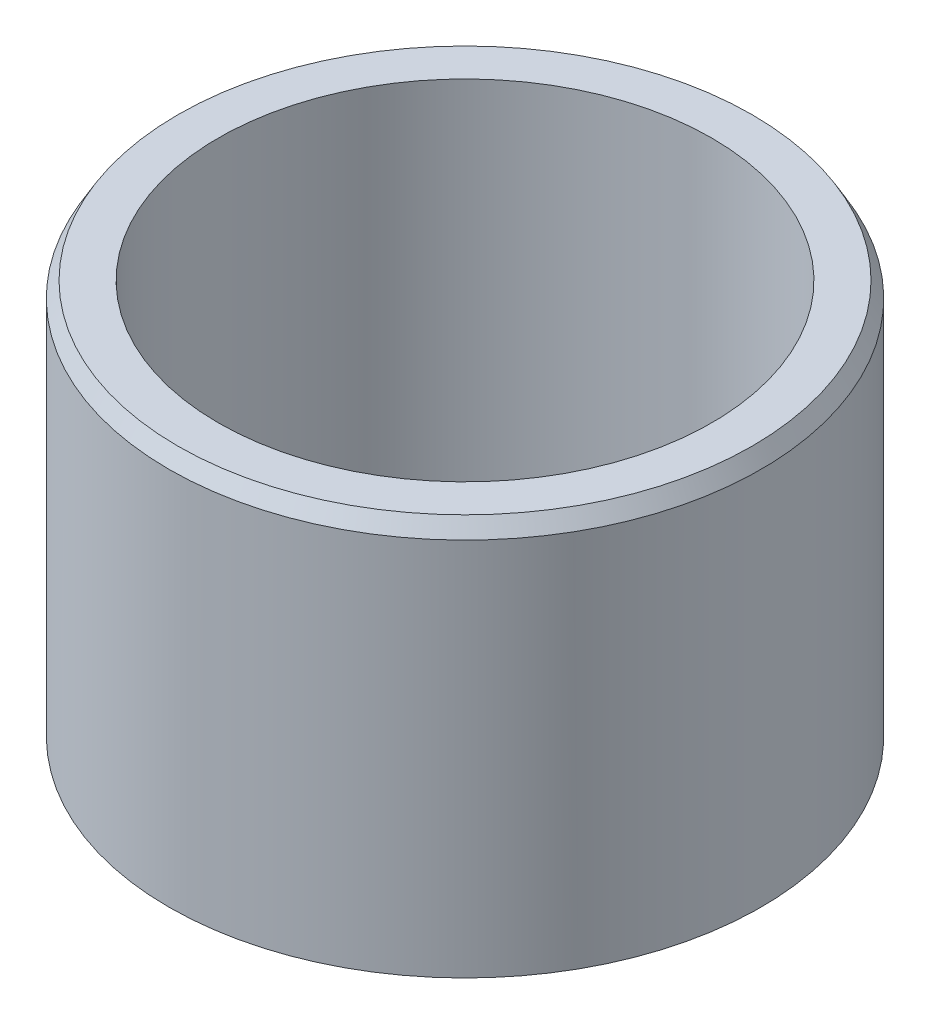
ISO-10303-21;
HEADER;
FILE_DESCRIPTION(('STEP AP214'),'2;1');
FILE_NAME('part.step','',(''),(''),'','','');
FILE_SCHEMA(('AUTOMOTIVE_DESIGN { 1 0 10303 214 1 1 1 1 }'));
ENDSEC;
DATA;
#1=APPLICATION_CONTEXT('core data for automotive mechanical design processes');
#2=APPLICATION_PROTOCOL_DEFINITION('international standard','automotive_design',2000,#1);
#3=PRODUCT_CONTEXT('',#1,'mechanical');
#4=PRODUCT('Part','Part','',(#3));
#5=PRODUCT_RELATED_PRODUCT_CATEGORY('part','',(#4));
#6=PRODUCT_DEFINITION_FORMATION('','',#4);
#7=PRODUCT_DEFINITION_CONTEXT('part definition',#1,'design');
#8=PRODUCT_DEFINITION('design','',#6,#7);
#9=PRODUCT_DEFINITION_SHAPE('','',#8);
#10=(LENGTH_UNIT() NAMED_UNIT(*) SI_UNIT(.MILLI.,.METRE.));
#11=(NAMED_UNIT(*) PLANE_ANGLE_UNIT() SI_UNIT($,.RADIAN.));
#12=(NAMED_UNIT(*) SI_UNIT($,.STERADIAN.) SOLID_ANGLE_UNIT());
#13=UNCERTAINTY_MEASURE_WITH_UNIT(LENGTH_MEASURE(1.E-05),#10,'distance_accuracy_value','');
#14=(GEOMETRIC_REPRESENTATION_CONTEXT(3) GLOBAL_UNCERTAINTY_ASSIGNED_CONTEXT((#13)) GLOBAL_UNIT_ASSIGNED_CONTEXT((#10,
#11,#12)) REPRESENTATION_CONTEXT('',''));
#15=CARTESIAN_POINT('',(0.,0.,0.));
#16=DIRECTION('',(0.,0.,1.));
#17=DIRECTION('',(1.,0.,0.));
#18=AXIS2_PLACEMENT_3D('',#15,#16,#17);
#19=CARTESIAN_POINT('',(0.,21.4398777173913,0.));
#20=DIRECTION('',(0.,1.,0.));
#21=DIRECTION('',(0.,0.,1.));
#22=AXIS2_PLACEMENT_3D('',#19,#20,#21);
#23=CYLINDRICAL_SURFACE('',#22,7.9375);
#24=CARTESIAN_POINT('',(0.,0.,0.));
#25=DIRECTION('',(0.,1.,0.));
#26=DIRECTION('',(0.,0.,1.));
#27=AXIS2_PLACEMENT_3D('',#24,#25,#26);
#28=CIRCLE('',#27,7.9375);
#29=CARTESIAN_POINT('',(0.,0.,7.9375));
#30=VERTEX_POINT('',#29);
#31=EDGE_CURVE('E42',#30,#30,#28,.T.);
#32=ORIENTED_EDGE('',*,*,#31,.F.);
#33=EDGE_LOOP('',(#32));
#34=FACE_BOUND('',#33,.T.);
#35=CARTESIAN_POINT('',(0.,12.7,0.));
#36=DIRECTION('',(0.,1.,0.));
#37=DIRECTION('',(0.,0.,1.));
#38=AXIS2_PLACEMENT_3D('',#35,#36,#37);
#39=CIRCLE('',#38,7.9375);
#40=CARTESIAN_POINT('',(0.,12.7,7.9375));
#41=VERTEX_POINT('',#40);
#42=EDGE_CURVE('E51',#41,#41,#39,.T.);
#43=ORIENTED_EDGE('',*,*,#42,.T.);
#44=EDGE_LOOP('',(#43));
#45=FACE_BOUND('',#44,.T.);
#46=ADVANCED_FACE('F31',(#34,#45),#23,.F.);
#47=CARTESIAN_POINT('',(7.9375,0.,0.));
#48=DIRECTION('',(0.,1.,0.));
#49=DIRECTION('',(0.,0.,1.));
#50=AXIS2_PLACEMENT_3D('',#47,#48,#49);
#51=PLANE('',#50);
#52=CARTESIAN_POINT('',(0.,0.,0.));
#53=DIRECTION('',(0.,1.,0.));
#54=DIRECTION('',(0.,0.,1.));
#55=AXIS2_PLACEMENT_3D('',#52,#53,#54);
#56=CIRCLE('',#55,9.525);
#57=CARTESIAN_POINT('',(0.,0.,9.525));
#58=VERTEX_POINT('',#57);
#59=EDGE_CURVE('E46',#58,#58,#56,.T.);
#60=ORIENTED_EDGE('',*,*,#59,.F.);
#61=EDGE_LOOP('',(#60));
#62=FACE_BOUND('',#61,.T.);
#63=ORIENTED_EDGE('',*,*,#31,.T.);
#64=EDGE_LOOP('',(#63));
#65=FACE_BOUND('',#64,.T.);
#66=ADVANCED_FACE('F65',(#62,#65),#51,.F.);
#67=CARTESIAN_POINT('',(0.,21.4398777173913,0.));
#68=DIRECTION('',(0.,1.,0.));
#69=DIRECTION('',(0.,0.,1.));
#70=AXIS2_PLACEMENT_3D('',#67,#68,#69);
#71=CYLINDRICAL_SURFACE('',#70,9.525);
#72=CARTESIAN_POINT('',(0.,12.19962,0.));
#73=DIRECTION('',(0.,-1.,0.));
#74=DIRECTION('',(0.,0.,-1.));
#75=AXIS2_PLACEMENT_3D('',#72,#73,#74);
#76=CIRCLE('',#75,9.525);
#77=CARTESIAN_POINT('',(0.,12.19962,-9.525));
#78=VERTEX_POINT('',#77);
#79=EDGE_CURVE('E10',#78,#78,#76,.T.);
#80=ORIENTED_EDGE('',*,*,#79,.T.);
#81=EDGE_LOOP('',(#80));
#82=FACE_BOUND('',#81,.T.);
#83=ORIENTED_EDGE('',*,*,#59,.T.);
#84=EDGE_LOOP('',(#83));
#85=FACE_BOUND('',#84,.T.);
#86=ADVANCED_FACE('F58',(#82,#85),#71,.T.);
#87=CARTESIAN_POINT('',(7.9375,12.7,0.));
#88=DIRECTION('',(0.,-1.,0.));
#89=DIRECTION('',(0.,0.,-1.));
#90=AXIS2_PLACEMENT_3D('',#87,#88,#89);
#91=PLANE('',#90);
#92=CARTESIAN_POINT('',(0.,12.7,0.));
#93=DIRECTION('',(0.,-1.,0.));
#94=DIRECTION('',(0.,0.,-1.));
#95=AXIS2_PLACEMENT_3D('',#92,#93,#94);
#96=CIRCLE('',#95,9.23610547230289);
#97=CARTESIAN_POINT('',(0.,12.7,-9.23610547230289));
#98=VERTEX_POINT('',#97);
#99=EDGE_CURVE('E38',#98,#98,#96,.F.);
#100=ORIENTED_EDGE('',*,*,#99,.T.);
#101=EDGE_LOOP('',(#100));
#102=FACE_BOUND('',#101,.T.);
#103=ORIENTED_EDGE('',*,*,#42,.F.);
#104=EDGE_LOOP('',(#103));
#105=FACE_BOUND('',#104,.T.);
#106=ADVANCED_FACE('F56',(#102,#105),#91,.F.);
#107=CARTESIAN_POINT('',(0.,12.7,0.));
#108=DIRECTION('',(0.,-1.,0.));
#109=DIRECTION('',(0.,0.,-1.));
#110=AXIS2_PLACEMENT_3D('',#107,#108,#109);
#111=CONICAL_SURFACE('',#110,9.23610547230289,0.523598775598297);
#112=ORIENTED_EDGE('',*,*,#79,.F.);
#113=EDGE_LOOP('',(#112));
#114=FACE_BOUND('',#113,.T.);
#115=ORIENTED_EDGE('',*,*,#99,.F.);
#116=EDGE_LOOP('',(#115));
#117=FACE_BOUND('',#116,.T.);
#118=ADVANCED_FACE('F33',(#114,#117),#111,.T.);
#119=CLOSED_SHELL('',(#46,#66,#86,#106,#118));
#120=MANIFOLD_SOLID_BREP('B2',#119);
#121=ADVANCED_BREP_SHAPE_REPRESENTATION('',(#18,#120),#14);
#122=SHAPE_DEFINITION_REPRESENTATION(#9,#121);
ENDSEC;
END-ISO-10303-21;
